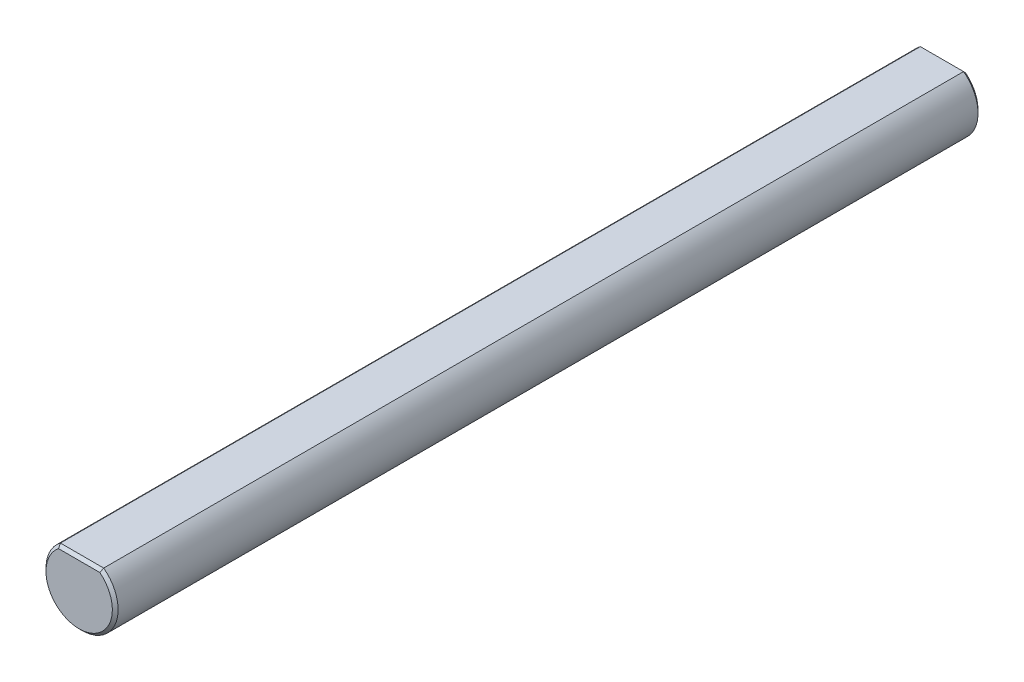
ISO-10303-21;
HEADER;
FILE_DESCRIPTION(('STEP AP214'),'2;1');
FILE_NAME('part.step','',(''),(''),'','','');
FILE_SCHEMA(('AUTOMOTIVE_DESIGN { 1 0 10303 214 1 1 1 1 }'));
ENDSEC;
DATA;
#1=APPLICATION_CONTEXT('core data for automotive mechanical design processes');
#2=APPLICATION_PROTOCOL_DEFINITION('international standard','automotive_design',2000,#1);
#3=PRODUCT_CONTEXT('',#1,'mechanical');
#4=PRODUCT('Part','Part','',(#3));
#5=PRODUCT_RELATED_PRODUCT_CATEGORY('part','',(#4));
#6=PRODUCT_DEFINITION_FORMATION('','',#4);
#7=PRODUCT_DEFINITION_CONTEXT('part definition',#1,'design');
#8=PRODUCT_DEFINITION('design','',#6,#7);
#9=PRODUCT_DEFINITION_SHAPE('','',#8);
#10=(LENGTH_UNIT() NAMED_UNIT(*) SI_UNIT(.MILLI.,.METRE.));
#11=(NAMED_UNIT(*) PLANE_ANGLE_UNIT() SI_UNIT($,.RADIAN.));
#12=(NAMED_UNIT(*) SI_UNIT($,.STERADIAN.) SOLID_ANGLE_UNIT());
#13=UNCERTAINTY_MEASURE_WITH_UNIT(LENGTH_MEASURE(1.E-05),#10,'distance_accuracy_value','');
#14=(GEOMETRIC_REPRESENTATION_CONTEXT(3) GLOBAL_UNCERTAINTY_ASSIGNED_CONTEXT((#13)) GLOBAL_UNIT_ASSIGNED_CONTEXT((#10,
#11,#12)) REPRESENTATION_CONTEXT('',''));
#15=CARTESIAN_POINT('',(0.,0.,0.));
#16=DIRECTION('',(0.,0.,1.));
#17=DIRECTION('',(1.,0.,0.));
#18=AXIS2_PLACEMENT_3D('',#15,#16,#17);
#19=CARTESIAN_POINT('',(0.,0.,38.1));
#20=DIRECTION('',(0.,0.,-1.));
#21=DIRECTION('',(-1.,0.,0.));
#22=AXIS2_PLACEMENT_3D('',#19,#20,#21);
#23=CYLINDRICAL_SURFACE('',#22,3.175);
#24=DIRECTION('',(0.,0.,-1.));
#25=VECTOR('',#24,1.);
#26=CARTESIAN_POINT('',(1.905,2.54,38.1));
#27=LINE('',#26,#25);
#28=CARTESIAN_POINT('',(1.905,2.54,37.846));
#29=VERTEX_POINT('',#28);
#30=CARTESIAN_POINT('',(1.905,2.54,-37.8459999999999));
#31=VERTEX_POINT('',#30);
#32=EDGE_CURVE('E98',#29,#31,#27,.T.);
#33=ORIENTED_EDGE('',*,*,#32,.F.);
#34=CARTESIAN_POINT('',(0.,0.,37.846));
#35=DIRECTION('',(0.,0.,1.));
#36=DIRECTION('',(1.,0.,0.));
#37=AXIS2_PLACEMENT_3D('',#34,#35,#36);
#38=CIRCLE('',#37,3.175);
#39=CARTESIAN_POINT('',(-1.905,2.54,37.846));
#40=VERTEX_POINT('',#39);
#41=EDGE_CURVE('E110',#29,#40,#38,.F.);
#42=ORIENTED_EDGE('',*,*,#41,.T.);
#43=DIRECTION('',(0.,0.,-1.));
#44=VECTOR('',#43,1.);
#45=CARTESIAN_POINT('',(-1.905,2.54,38.1));
#46=LINE('',#45,#44);
#47=CARTESIAN_POINT('',(-1.905,2.54,-37.8459999999999));
#48=VERTEX_POINT('',#47);
#49=EDGE_CURVE('E147',#40,#48,#46,.T.);
#50=ORIENTED_EDGE('',*,*,#49,.T.);
#51=CARTESIAN_POINT('',(0.,0.,-37.8459999999999));
#52=DIRECTION('',(0.,0.,1.));
#53=DIRECTION('',(1.,0.,0.));
#54=AXIS2_PLACEMENT_3D('',#51,#52,#53);
#55=CIRCLE('',#54,3.175);
#56=EDGE_CURVE('E108',#48,#31,#55,.T.);
#57=ORIENTED_EDGE('',*,*,#56,.T.);
#58=EDGE_LOOP('',(#33,#42,#50,#57));
#59=FACE_BOUND('',#58,.T.);
#60=ADVANCED_FACE('F36',(#59),#23,.T.);
#61=CARTESIAN_POINT('',(1.905,2.54,38.1));
#62=DIRECTION('',(0.,-1.,0.));
#63=DIRECTION('',(0.,0.,-1.));
#64=AXIS2_PLACEMENT_3D('',#61,#62,#63);
#65=PLANE('',#64);
#66=ORIENTED_EDGE('',*,*,#49,.F.);
#67=DIRECTION('',(1.,0.,0.));
#68=VECTOR('',#67,1.);
#69=CARTESIAN_POINT('',(1.905,2.54,37.846));
#70=LINE('',#69,#68);
#71=EDGE_CURVE('E89',#40,#29,#70,.T.);
#72=ORIENTED_EDGE('',*,*,#71,.T.);
#73=ORIENTED_EDGE('',*,*,#32,.T.);
#74=DIRECTION('',(-1.,0.,0.));
#75=VECTOR('',#74,1.);
#76=CARTESIAN_POINT('',(1.905,2.54,-37.8459999999999));
#77=LINE('',#76,#75);
#78=EDGE_CURVE('E101',#31,#48,#77,.T.);
#79=ORIENTED_EDGE('',*,*,#78,.T.);
#80=EDGE_LOOP('',(#66,#72,#73,#79));
#81=FACE_BOUND('',#80,.T.);
#82=ADVANCED_FACE('F146',(#81),#65,.F.);
#83=CARTESIAN_POINT('',(0.,0.,38.1));
#84=DIRECTION('',(0.,0.,1.));
#85=DIRECTION('',(1.,0.,0.));
#86=AXIS2_PLACEMENT_3D('',#83,#84,#85);
#87=PLANE('',#86);
#88=CARTESIAN_POINT('',(0.,0.,38.1));
#89=DIRECTION('',(0.,0.,1.));
#90=DIRECTION('',(1.,0.,0.));
#91=AXIS2_PLACEMENT_3D('',#88,#89,#90);
#92=CIRCLE('',#91,2.92100000000003);
#93=CARTESIAN_POINT('',(-1.81836327503615,2.286,38.1));
#94=VERTEX_POINT('',#93);
#95=CARTESIAN_POINT('',(1.81836327503615,2.286,38.1));
#96=VERTEX_POINT('',#95);
#97=EDGE_CURVE('E95',#94,#96,#92,.T.);
#98=ORIENTED_EDGE('',*,*,#97,.T.);
#99=DIRECTION('',(-1.,0.,0.));
#100=VECTOR('',#99,1.);
#101=CARTESIAN_POINT('',(-1.905,2.28600000000003,38.1));
#102=LINE('',#101,#100);
#103=EDGE_CURVE('E87',#96,#94,#102,.T.);
#104=ORIENTED_EDGE('',*,*,#103,.T.);
#105=EDGE_LOOP('',(#98,#104));
#106=FACE_BOUND('',#105,.T.);
#107=ADVANCED_FACE('F100',(#106),#87,.T.);
#108=CARTESIAN_POINT('',(0.,0.,-38.1));
#109=DIRECTION('',(0.,0.,1.));
#110=DIRECTION('',(1.,0.,0.));
#111=AXIS2_PLACEMENT_3D('',#108,#109,#110);
#112=PLANE('',#111);
#113=CARTESIAN_POINT('',(0.,0.,-38.1));
#114=DIRECTION('',(0.,0.,1.));
#115=DIRECTION('',(1.,0.,0.));
#116=AXIS2_PLACEMENT_3D('',#113,#114,#115);
#117=CIRCLE('',#116,2.92099999999994);
#118=CARTESIAN_POINT('',(1.81836327503612,2.2859999999999,-38.1));
#119=VERTEX_POINT('',#118);
#120=CARTESIAN_POINT('',(-1.81836327503612,2.2859999999999,-38.1));
#121=VERTEX_POINT('',#120);
#122=EDGE_CURVE('E50',#119,#121,#117,.F.);
#123=ORIENTED_EDGE('',*,*,#122,.T.);
#124=DIRECTION('',(1.,0.,0.));
#125=VECTOR('',#124,1.);
#126=CARTESIAN_POINT('',(0.,2.28599999999994,-38.1));
#127=LINE('',#126,#125);
#128=EDGE_CURVE('E11',#121,#119,#127,.T.);
#129=ORIENTED_EDGE('',*,*,#128,.T.);
#130=EDGE_LOOP('',(#123,#129));
#131=FACE_BOUND('',#130,.T.);
#132=ADVANCED_FACE('F155',(#131),#112,.F.);
#133=CARTESIAN_POINT('',(0.,0.,38.1));
#134=DIRECTION('',(0.,0.,-1.));
#135=DIRECTION('',(-1.,0.,0.));
#136=AXIS2_PLACEMENT_3D('',#133,#134,#135);
#137=CONICAL_SURFACE('',#136,2.92100000000003,0.785398163397454);
#138=CARTESIAN_POINT('',(-1.81836327503618,2.28600000000003,38.1));
#139=CARTESIAN_POINT('',(-1.83312020816111,2.32827920209278,38.0577207979073));
#140=CARTESIAN_POINT('',(-1.84771840387271,2.3705854760154,38.0154145239846));
#141=CARTESIAN_POINT('',(-1.87659731200799,2.45525214271378,37.9307478572863));
#142=CARTESIAN_POINT('',(-1.8908780246177,2.49761253545781,37.8883874645422));
#143=CARTESIAN_POINT('',(-1.90500000000012,2.53999999999998,37.8460000000001));
#144=B_SPLINE_CURVE_WITH_KNOTS('',3,(#138,#139,#140,#141,#142,#143),.UNSPECIFIED.,.F.,.F.,(4,2,
4),(0.,0.184755894358444,0.369511680453177),.UNSPECIFIED.);
#145=EDGE_CURVE('E83',#40,#94,#144,.F.);
#146=ORIENTED_EDGE('',*,*,#145,.F.);
#147=ORIENTED_EDGE('',*,*,#41,.F.);
#148=CARTESIAN_POINT('',(1.905,2.54,37.846));
#149=CARTESIAN_POINT('',(1.89087802461764,2.49761253545782,37.8883874645422));
#150=CARTESIAN_POINT('',(1.87659731200797,2.45525214271378,37.9307478572862));
#151=CARTESIAN_POINT('',(1.84771840387274,2.3705854760154,38.0154145239846));
#152=CARTESIAN_POINT('',(1.83312020816115,2.32827920209278,38.0577207979073));
#153=CARTESIAN_POINT('',(1.81836327503622,2.28600000000003,38.1));
#154=B_SPLINE_CURVE_WITH_KNOTS('',3,(#148,#149,#150,#151,#152,#153),.UNSPECIFIED.,.F.,.F.,(4,2,
4),(0.,0.184755786094727,0.369511680453178),.UNSPECIFIED.);
#155=EDGE_CURVE('E92',#96,#29,#154,.F.);
#156=ORIENTED_EDGE('',*,*,#155,.F.);
#157=ORIENTED_EDGE('',*,*,#97,.F.);
#158=EDGE_LOOP('',(#146,#147,#156,#157));
#159=FACE_BOUND('',#158,.T.);
#160=ADVANCED_FACE('F96',(#159),#137,.T.);
#161=CARTESIAN_POINT('',(0.,2.28600000000003,38.1));
#162=DIRECTION('',(0.,0.707106781186543,0.707106781186552));
#163=DIRECTION('',(1.,0.,0.));
#164=AXIS2_PLACEMENT_3D('',#161,#162,#163);
#165=PLANE('',#164);
#166=ORIENTED_EDGE('',*,*,#155,.T.);
#167=ORIENTED_EDGE('',*,*,#71,.F.);
#168=ORIENTED_EDGE('',*,*,#145,.T.);
#169=ORIENTED_EDGE('',*,*,#103,.F.);
#170=EDGE_LOOP('',(#166,#167,#168,#169));
#171=FACE_BOUND('',#170,.T.);
#172=ADVANCED_FACE('F85',(#171),#165,.T.);
#173=CARTESIAN_POINT('',(0.,0.,-37.8459999999999));
#174=DIRECTION('',(0.,0.,1.));
#175=DIRECTION('',(1.,0.,0.));
#176=AXIS2_PLACEMENT_3D('',#173,#174,#175);
#177=CONICAL_SURFACE('',#176,3.175,0.785398163397454);
#178=CARTESIAN_POINT('',(-1.905,2.54,-37.8459999999999));
#179=CARTESIAN_POINT('',(-1.89087802461763,2.4976125354578,-37.8883874645421));
#180=CARTESIAN_POINT('',(-1.87659731200796,2.45525214271375,-37.9307478572862));
#181=CARTESIAN_POINT('',(-1.84771840387272,2.37058547601533,-38.0154145239846));
#182=CARTESIAN_POINT('',(-1.83312020816112,2.3282792020927,-38.0577207979072));
#183=CARTESIAN_POINT('',(-1.81836327503618,2.28599999999993,-38.1));
#184=B_SPLINE_CURVE_WITH_KNOTS('',3,(#178,#179,#180,#181,#182,#183),.UNSPECIFIED.,.F.,.F.,(4,2,
4),(0.,0.184755786094804,0.369511680453319),.UNSPECIFIED.);
#185=EDGE_CURVE('E133',#121,#48,#184,.F.);
#186=ORIENTED_EDGE('',*,*,#185,.F.);
#187=ORIENTED_EDGE('',*,*,#122,.F.);
#188=CARTESIAN_POINT('',(1.81836327503615,2.28599999999994,-38.1));
#189=CARTESIAN_POINT('',(1.83312020816108,2.3282792020927,-38.0577207979072));
#190=CARTESIAN_POINT('',(1.84771840387269,2.37058547601534,-38.0154145239846));
#191=CARTESIAN_POINT('',(1.87659731200798,2.45525214271375,-37.9307478572862));
#192=CARTESIAN_POINT('',(1.8908780246177,2.49761253545779,-37.8883874645421));
#193=CARTESIAN_POINT('',(1.90500000000012,2.53999999999998,-37.846));
#194=B_SPLINE_CURVE_WITH_KNOTS('',3,(#188,#189,#190,#191,#192,#193),.UNSPECIFIED.,.F.,.F.,(4,2,
4),(0.,0.184755894358521,0.369511680453318),.UNSPECIFIED.);
#195=EDGE_CURVE('E41',#31,#119,#194,.F.);
#196=ORIENTED_EDGE('',*,*,#195,.F.);
#197=ORIENTED_EDGE('',*,*,#56,.F.);
#198=EDGE_LOOP('',(#186,#187,#196,#197));
#199=FACE_BOUND('',#198,.T.);
#200=ADVANCED_FACE('F127',(#199),#177,.T.);
#201=CARTESIAN_POINT('',(1.905,2.54,-37.8459999999999));
#202=DIRECTION('',(0.,-0.707106781186543,0.707106781186552));
#203=DIRECTION('',(-1.,0.,0.));
#204=AXIS2_PLACEMENT_3D('',#201,#202,#203);
#205=PLANE('',#204);
#206=ORIENTED_EDGE('',*,*,#195,.T.);
#207=ORIENTED_EDGE('',*,*,#128,.F.);
#208=ORIENTED_EDGE('',*,*,#185,.T.);
#209=ORIENTED_EDGE('',*,*,#78,.F.);
#210=EDGE_LOOP('',(#206,#207,#208,#209));
#211=FACE_BOUND('',#210,.T.);
#212=ADVANCED_FACE('F38',(#211),#205,.F.);
#213=CLOSED_SHELL('',(#60,#82,#107,#132,#160,#172,#200,#212));
#214=MANIFOLD_SOLID_BREP('B2',#213);
#215=ADVANCED_BREP_SHAPE_REPRESENTATION('',(#18,#214),#14);
#216=SHAPE_DEFINITION_REPRESENTATION(#9,#215);
ENDSEC;
END-ISO-10303-21;
